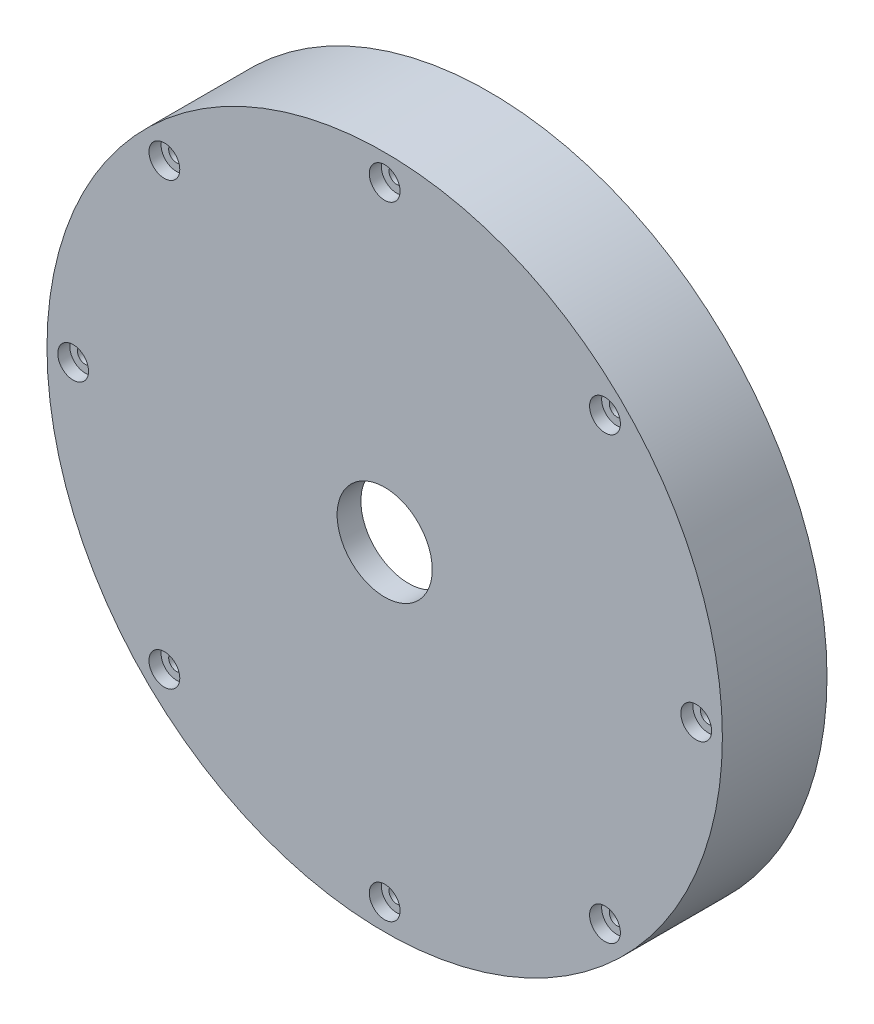
ISO-10303-21;
HEADER;
FILE_DESCRIPTION(('STEP AP214'),'2;1');
FILE_NAME('part.step','',(''),(''),'','','');
FILE_SCHEMA(('AUTOMOTIVE_DESIGN { 1 0 10303 214 1 1 1 1 }'));
ENDSEC;
DATA;
#1=APPLICATION_CONTEXT('core data for automotive mechanical design processes');
#2=APPLICATION_PROTOCOL_DEFINITION('international standard','automotive_design',2000,#1);
#3=PRODUCT_CONTEXT('',#1,'mechanical');
#4=PRODUCT('Part','Part','',(#3));
#5=PRODUCT_RELATED_PRODUCT_CATEGORY('part','',(#4));
#6=PRODUCT_DEFINITION_FORMATION('','',#4);
#7=PRODUCT_DEFINITION_CONTEXT('part definition',#1,'design');
#8=PRODUCT_DEFINITION('design','',#6,#7);
#9=PRODUCT_DEFINITION_SHAPE('','',#8);
#10=(LENGTH_UNIT() NAMED_UNIT(*) SI_UNIT(.MILLI.,.METRE.));
#11=(NAMED_UNIT(*) PLANE_ANGLE_UNIT() SI_UNIT($,.RADIAN.));
#12=(NAMED_UNIT(*) SI_UNIT($,.STERADIAN.) SOLID_ANGLE_UNIT());
#13=UNCERTAINTY_MEASURE_WITH_UNIT(LENGTH_MEASURE(1.E-05),#10,'distance_accuracy_value','');
#14=(GEOMETRIC_REPRESENTATION_CONTEXT(3) GLOBAL_UNCERTAINTY_ASSIGNED_CONTEXT((#13)) GLOBAL_UNIT_ASSIGNED_CONTEXT((#10,
#11,#12)) REPRESENTATION_CONTEXT('',''));
#15=CARTESIAN_POINT('',(0.,0.,0.));
#16=DIRECTION('',(0.,0.,1.));
#17=DIRECTION('',(1.,0.,0.));
#18=AXIS2_PLACEMENT_3D('',#15,#16,#17);
#19=CARTESIAN_POINT('',(46.3154941677197,46.3154941677208,0.));
#20=DIRECTION('',(0.,0.,1.));
#21=DIRECTION('',(1.,0.,0.));
#22=AXIS2_PLACEMENT_3D('',#19,#20,#21);
#23=CYLINDRICAL_SURFACE('',#22,1.63703000000032);
#24=CARTESIAN_POINT('',(46.3154941677197,46.3154941677208,0.));
#25=DIRECTION('',(0.,0.,1.));
#26=DIRECTION('',(1.,0.,0.));
#27=AXIS2_PLACEMENT_3D('',#24,#25,#26);
#28=CIRCLE('',#27,1.63703000000032);
#29=CARTESIAN_POINT('',(47.95252416772,46.3154941677208,0.));
#30=VERTEX_POINT('',#29);
#31=EDGE_CURVE('E87',#30,#30,#28,.T.);
#32=ORIENTED_EDGE('',*,*,#31,.F.);
#33=EDGE_LOOP('',(#32));
#34=FACE_BOUND('',#33,.T.);
#35=CARTESIAN_POINT('',(46.3154941677197,46.3154941677208,19.46));
#36=DIRECTION('',(0.,0.,1.));
#37=DIRECTION('',(1.,0.,0.));
#38=AXIS2_PLACEMENT_3D('',#35,#36,#37);
#39=CIRCLE('',#38,1.63703000000032);
#40=CARTESIAN_POINT('',(47.95252416772,46.3154941677208,19.46));
#41=VERTEX_POINT('',#40);
#42=EDGE_CURVE('E35',#41,#41,#39,.F.);
#43=ORIENTED_EDGE('',*,*,#42,.F.);
#44=EDGE_LOOP('',(#43));
#45=FACE_BOUND('',#44,.T.);
#46=ADVANCED_FACE('F31',(#34,#45),#23,.F.);
#47=CARTESIAN_POINT('',(0.,65.5,0.));
#48=DIRECTION('',(0.,0.,1.));
#49=DIRECTION('',(1.,0.,0.));
#50=AXIS2_PLACEMENT_3D('',#47,#48,#49);
#51=CYLINDRICAL_SURFACE('',#50,1.63703);
#52=CARTESIAN_POINT('',(0.,65.5,0.));
#53=DIRECTION('',(0.,0.,1.));
#54=DIRECTION('',(1.,0.,0.));
#55=AXIS2_PLACEMENT_3D('',#52,#53,#54);
#56=CIRCLE('',#55,1.63703);
#57=CARTESIAN_POINT('',(1.63703,65.5,0.));
#58=VERTEX_POINT('',#57);
#59=EDGE_CURVE('E71',#58,#58,#56,.T.);
#60=ORIENTED_EDGE('',*,*,#59,.F.);
#61=EDGE_LOOP('',(#60));
#62=FACE_BOUND('',#61,.T.);
#63=CARTESIAN_POINT('',(0.,65.5,19.46));
#64=DIRECTION('',(0.,0.,1.));
#65=DIRECTION('',(1.,0.,0.));
#66=AXIS2_PLACEMENT_3D('',#63,#64,#65);
#67=CIRCLE('',#66,1.63703);
#68=CARTESIAN_POINT('',(1.63703,65.5,19.46));
#69=VERTEX_POINT('',#68);
#70=EDGE_CURVE('E66',#69,#69,#67,.F.);
#71=ORIENTED_EDGE('',*,*,#70,.F.);
#72=EDGE_LOOP('',(#71));
#73=FACE_BOUND('',#72,.T.);
#74=ADVANCED_FACE('F127',(#62,#73),#51,.F.);
#75=CARTESIAN_POINT('',(-46.3154941677181,46.3154941677169,0.));
#76=DIRECTION('',(0.,0.,1.));
#77=DIRECTION('',(1.,0.,0.));
#78=AXIS2_PLACEMENT_3D('',#75,#76,#77);
#79=CYLINDRICAL_SURFACE('',#78,1.63703000000213);
#80=CARTESIAN_POINT('',(-46.3154941677181,46.3154941677169,0.));
#81=DIRECTION('',(0.,0.,1.));
#82=DIRECTION('',(1.,0.,0.));
#83=AXIS2_PLACEMENT_3D('',#80,#81,#82);
#84=CIRCLE('',#83,1.63703000000213);
#85=CARTESIAN_POINT('',(-44.6784641677159,46.3154941677169,0.));
#86=VERTEX_POINT('',#85);
#87=EDGE_CURVE('E75',#86,#86,#84,.T.);
#88=ORIENTED_EDGE('',*,*,#87,.F.);
#89=EDGE_LOOP('',(#88));
#90=FACE_BOUND('',#89,.T.);
#91=CARTESIAN_POINT('',(-46.3154941677181,46.3154941677169,19.46));
#92=DIRECTION('',(0.,0.,1.));
#93=DIRECTION('',(1.,0.,0.));
#94=AXIS2_PLACEMENT_3D('',#91,#92,#93);
#95=CIRCLE('',#94,1.63703000000213);
#96=CARTESIAN_POINT('',(-44.6784641677159,46.3154941677169,19.46));
#97=VERTEX_POINT('',#96);
#98=EDGE_CURVE('E64',#97,#97,#95,.F.);
#99=ORIENTED_EDGE('',*,*,#98,.F.);
#100=EDGE_LOOP('',(#99));
#101=FACE_BOUND('',#100,.T.);
#102=ADVANCED_FACE('F133',(#90,#101),#79,.F.);
#103=CARTESIAN_POINT('',(-65.4999999999972,-2.78842223326999E-12,0.));
#104=DIRECTION('',(0.,0.,1.));
#105=DIRECTION('',(1.,0.,0.));
#106=AXIS2_PLACEMENT_3D('',#103,#104,#105);
#107=CYLINDRICAL_SURFACE('',#106,1.63703000000413);
#108=CARTESIAN_POINT('',(-65.4999999999972,-2.78842223326999E-12,0.));
#109=DIRECTION('',(0.,0.,1.));
#110=DIRECTION('',(1.,0.,0.));
#111=AXIS2_PLACEMENT_3D('',#108,#109,#110);
#112=CIRCLE('',#111,1.63703000000413);
#113=CARTESIAN_POINT('',(-63.8629699999931,-2.78842223326999E-12,0.));
#114=VERTEX_POINT('',#113);
#115=EDGE_CURVE('E80',#114,#114,#112,.T.);
#116=ORIENTED_EDGE('',*,*,#115,.F.);
#117=EDGE_LOOP('',(#116));
#118=FACE_BOUND('',#117,.T.);
#119=CARTESIAN_POINT('',(-65.4999999999972,-2.78842223326999E-12,19.46));
#120=DIRECTION('',(0.,0.,1.));
#121=DIRECTION('',(1.,0.,0.));
#122=AXIS2_PLACEMENT_3D('',#119,#120,#121);
#123=CIRCLE('',#122,1.63703000000413);
#124=CARTESIAN_POINT('',(-63.8629699999931,-2.78842223326999E-12,19.46));
#125=VERTEX_POINT('',#124);
#126=EDGE_CURVE('E61',#125,#125,#123,.F.);
#127=ORIENTED_EDGE('',*,*,#126,.F.);
#128=EDGE_LOOP('',(#127));
#129=FACE_BOUND('',#128,.T.);
#130=ADVANCED_FACE('F207',(#118,#129),#107,.F.);
#131=CARTESIAN_POINT('',(-46.3154941677141,-46.3154941677208,0.));
#132=DIRECTION('',(0.,0.,1.));
#133=DIRECTION('',(1.,0.,0.));
#134=AXIS2_PLACEMENT_3D('',#131,#132,#133);
#135=CYLINDRICAL_SURFACE('',#134,1.63703000000566);
#136=CARTESIAN_POINT('',(-46.3154941677141,-46.3154941677208,0.));
#137=DIRECTION('',(0.,0.,1.));
#138=DIRECTION('',(1.,0.,0.));
#139=AXIS2_PLACEMENT_3D('',#136,#137,#138);
#140=CIRCLE('',#139,1.63703000000566);
#141=CARTESIAN_POINT('',(-44.6784641677085,-46.3154941677208,0.));
#142=VERTEX_POINT('',#141);
#143=EDGE_CURVE('E94',#142,#142,#140,.T.);
#144=ORIENTED_EDGE('',*,*,#143,.F.);
#145=EDGE_LOOP('',(#144));
#146=FACE_BOUND('',#145,.T.);
#147=CARTESIAN_POINT('',(-46.3154941677141,-46.3154941677208,19.46));
#148=DIRECTION('',(0.,0.,1.));
#149=DIRECTION('',(1.,0.,0.));
#150=AXIS2_PLACEMENT_3D('',#147,#148,#149);
#151=CIRCLE('',#150,1.63703000000566);
#152=CARTESIAN_POINT('',(-44.6784641677085,-46.3154941677208,19.46));
#153=VERTEX_POINT('',#152);
#154=EDGE_CURVE('E58',#153,#153,#151,.F.);
#155=ORIENTED_EDGE('',*,*,#154,.F.);
#156=EDGE_LOOP('',(#155));
#157=FACE_BOUND('',#156,.T.);
#158=ADVANCED_FACE('F140',(#146,#157),#135,.F.);
#159=CARTESIAN_POINT('',(5.56080159347114E-12,-65.5,0.));
#160=DIRECTION('',(0.,0.,1.));
#161=DIRECTION('',(1.,0.,0.));
#162=AXIS2_PLACEMENT_3D('',#159,#160,#161);
#163=CYLINDRICAL_SURFACE('',#162,1.63703000000575);
#164=CARTESIAN_POINT('',(5.56080159347114E-12,-65.5,0.));
#165=DIRECTION('',(0.,0.,1.));
#166=DIRECTION('',(1.,0.,0.));
#167=AXIS2_PLACEMENT_3D('',#164,#165,#166);
#168=CIRCLE('',#167,1.63703000000575);
#169=CARTESIAN_POINT('',(1.63703000001131,-65.5,0.));
#170=VERTEX_POINT('',#169);
#171=EDGE_CURVE('E91',#170,#170,#168,.T.);
#172=ORIENTED_EDGE('',*,*,#171,.F.);
#173=EDGE_LOOP('',(#172));
#174=FACE_BOUND('',#173,.T.);
#175=CARTESIAN_POINT('',(5.56080159347114E-12,-65.5,19.46));
#176=DIRECTION('',(0.,0.,1.));
#177=DIRECTION('',(1.,0.,0.));
#178=AXIS2_PLACEMENT_3D('',#175,#176,#177);
#179=CIRCLE('',#178,1.63703000000575);
#180=CARTESIAN_POINT('',(1.63703000001131,-65.5,19.46));
#181=VERTEX_POINT('',#180);
#182=EDGE_CURVE('E55',#181,#181,#179,.F.);
#183=ORIENTED_EDGE('',*,*,#182,.F.);
#184=EDGE_LOOP('',(#183));
#185=FACE_BOUND('',#184,.T.);
#186=ADVANCED_FACE('F221',(#174,#185),#163,.F.);
#187=CARTESIAN_POINT('',(46.3154941677236,-46.3154941677169,0.));
#188=DIRECTION('',(0.,0.,1.));
#189=DIRECTION('',(1.,0.,0.));
#190=AXIS2_PLACEMENT_3D('',#187,#188,#189);
#191=CYLINDRICAL_SURFACE('',#190,1.63703000000429);
#192=CARTESIAN_POINT('',(46.3154941677236,-46.3154941677169,0.));
#193=DIRECTION('',(0.,0.,1.));
#194=DIRECTION('',(1.,0.,0.));
#195=AXIS2_PLACEMENT_3D('',#192,#193,#194);
#196=CIRCLE('',#195,1.63703000000429);
#197=CARTESIAN_POINT('',(47.9525241677279,-46.3154941677169,0.));
#198=VERTEX_POINT('',#197);
#199=EDGE_CURVE('E88',#198,#198,#196,.T.);
#200=ORIENTED_EDGE('',*,*,#199,.F.);
#201=EDGE_LOOP('',(#200));
#202=FACE_BOUND('',#201,.T.);
#203=CARTESIAN_POINT('',(46.3154941677236,-46.3154941677169,19.46));
#204=DIRECTION('',(0.,0.,1.));
#205=DIRECTION('',(1.,0.,0.));
#206=AXIS2_PLACEMENT_3D('',#203,#204,#205);
#207=CIRCLE('',#206,1.63703000000429);
#208=CARTESIAN_POINT('',(47.9525241677279,-46.3154941677169,19.46));
#209=VERTEX_POINT('',#208);
#210=EDGE_CURVE('E51',#209,#209,#207,.F.);
#211=ORIENTED_EDGE('',*,*,#210,.F.);
#212=EDGE_LOOP('',(#211));
#213=FACE_BOUND('',#212,.T.);
#214=ADVANCED_FACE('F218',(#202,#213),#191,.F.);
#215=CARTESIAN_POINT('',(65.5000000000028,2.78040079673557E-12,0.));
#216=DIRECTION('',(0.,0.,1.));
#217=DIRECTION('',(1.,0.,0.));
#218=AXIS2_PLACEMENT_3D('',#215,#216,#217);
#219=CYLINDRICAL_SURFACE('',#218,1.63703000000207);
#220=CARTESIAN_POINT('',(65.5000000000028,2.78040079673557E-12,0.));
#221=DIRECTION('',(0.,0.,1.));
#222=DIRECTION('',(1.,0.,0.));
#223=AXIS2_PLACEMENT_3D('',#220,#221,#222);
#224=CIRCLE('',#223,1.63703000000207);
#225=CARTESIAN_POINT('',(67.1370300000048,2.78040079673557E-12,0.));
#226=VERTEX_POINT('',#225);
#227=EDGE_CURVE('E84',#226,#226,#224,.T.);
#228=ORIENTED_EDGE('',*,*,#227,.F.);
#229=EDGE_LOOP('',(#228));
#230=FACE_BOUND('',#229,.T.);
#231=CARTESIAN_POINT('',(65.5000000000028,2.78040079673557E-12,19.46));
#232=DIRECTION('',(0.,0.,1.));
#233=DIRECTION('',(1.,0.,0.));
#234=AXIS2_PLACEMENT_3D('',#231,#232,#233);
#235=CIRCLE('',#234,1.63703000000207);
#236=CARTESIAN_POINT('',(67.1370300000048,2.78040079673557E-12,19.46));
#237=VERTEX_POINT('',#236);
#238=EDGE_CURVE('E48',#237,#237,#235,.F.);
#239=ORIENTED_EDGE('',*,*,#238,.F.);
#240=EDGE_LOOP('',(#239));
#241=FACE_BOUND('',#240,.T.);
#242=ADVANCED_FACE('F214',(#230,#241),#219,.F.);
#243=CARTESIAN_POINT('',(0.,0.,0.));
#244=DIRECTION('',(0.,0.,1.));
#245=DIRECTION('',(1.,0.,0.));
#246=AXIS2_PLACEMENT_3D('',#243,#244,#245);
#247=PLANE('',#246);
#248=ORIENTED_EDGE('',*,*,#227,.T.);
#249=EDGE_LOOP('',(#248));
#250=FACE_BOUND('',#249,.T.);
#251=ORIENTED_EDGE('',*,*,#199,.T.);
#252=EDGE_LOOP('',(#251));
#253=FACE_BOUND('',#252,.T.);
#254=ORIENTED_EDGE('',*,*,#171,.T.);
#255=EDGE_LOOP('',(#254));
#256=FACE_BOUND('',#255,.T.);
#257=ORIENTED_EDGE('',*,*,#143,.T.);
#258=EDGE_LOOP('',(#257));
#259=FACE_BOUND('',#258,.T.);
#260=ORIENTED_EDGE('',*,*,#115,.T.);
#261=EDGE_LOOP('',(#260));
#262=FACE_BOUND('',#261,.T.);
#263=ORIENTED_EDGE('',*,*,#87,.T.);
#264=EDGE_LOOP('',(#263));
#265=FACE_BOUND('',#264,.T.);
#266=ORIENTED_EDGE('',*,*,#59,.T.);
#267=EDGE_LOOP('',(#266));
#268=FACE_BOUND('',#267,.T.);
#269=ORIENTED_EDGE('',*,*,#31,.T.);
#270=EDGE_LOOP('',(#269));
#271=FACE_BOUND('',#270,.T.);
#272=CARTESIAN_POINT('',(0.,0.,0.));
#273=DIRECTION('',(0.,0.,1.));
#274=DIRECTION('',(1.,0.,0.));
#275=AXIS2_PLACEMENT_3D('',#272,#273,#274);
#276=CIRCLE('',#275,71.);
#277=CARTESIAN_POINT('',(71.,0.,0.));
#278=VERTEX_POINT('',#277);
#279=EDGE_CURVE('E10',#278,#278,#276,.T.);
#280=ORIENTED_EDGE('',*,*,#279,.F.);
#281=EDGE_LOOP('',(#280));
#282=FACE_BOUND('',#281,.T.);
#283=CARTESIAN_POINT('',(0.,0.,0.));
#284=DIRECTION('',(0.,0.,1.));
#285=DIRECTION('',(1.,0.,0.));
#286=AXIS2_PLACEMENT_3D('',#283,#284,#285);
#287=CIRCLE('',#286,60.);
#288=CARTESIAN_POINT('',(60.,0.,0.));
#289=VERTEX_POINT('',#288);
#290=EDGE_CURVE('E39',#289,#289,#287,.T.);
#291=ORIENTED_EDGE('',*,*,#290,.T.);
#292=EDGE_LOOP('',(#291));
#293=FACE_BOUND('',#292,.T.);
#294=ADVANCED_FACE('F217',(#250,#253,#256,#259,#262,#265,#268,#271,#282,#293),#247,.F.);
#295=CARTESIAN_POINT('',(0.,0.,17.));
#296=DIRECTION('',(0.,0.,-1.));
#297=DIRECTION('',(-1.,0.,0.));
#298=AXIS2_PLACEMENT_3D('',#295,#296,#297);
#299=CYLINDRICAL_SURFACE('',#298,71.);
#300=ORIENTED_EDGE('',*,*,#279,.T.);
#301=EDGE_LOOP('',(#300));
#302=FACE_BOUND('',#301,.T.);
#303=CARTESIAN_POINT('',(0.,0.,22.));
#304=DIRECTION('',(0.,0.,1.));
#305=DIRECTION('',(1.,0.,0.));
#306=AXIS2_PLACEMENT_3D('',#303,#304,#305);
#307=CIRCLE('',#306,71.);
#308=CARTESIAN_POINT('',(71.,0.,22.));
#309=VERTEX_POINT('',#308);
#310=EDGE_CURVE('E103',#309,#309,#307,.T.);
#311=ORIENTED_EDGE('',*,*,#310,.F.);
#312=EDGE_LOOP('',(#311));
#313=FACE_BOUND('',#312,.T.);
#314=ADVANCED_FACE('F33',(#302,#313),#299,.T.);
#315=CARTESIAN_POINT('',(0.,0.,17.));
#316=DIRECTION('',(0.,0.,-1.));
#317=DIRECTION('',(-1.,0.,0.));
#318=AXIS2_PLACEMENT_3D('',#315,#316,#317);
#319=CYLINDRICAL_SURFACE('',#318,60.);
#320=CARTESIAN_POINT('',(0.,0.,17.));
#321=DIRECTION('',(0.,0.,1.));
#322=DIRECTION('',(1.,0.,0.));
#323=AXIS2_PLACEMENT_3D('',#320,#321,#322);
#324=CIRCLE('',#323,60.);
#325=CARTESIAN_POINT('',(60.,0.,17.));
#326=VERTEX_POINT('',#325);
#327=EDGE_CURVE('E44',#326,#326,#324,.T.);
#328=ORIENTED_EDGE('',*,*,#327,.T.);
#329=EDGE_LOOP('',(#328));
#330=FACE_BOUND('',#329,.T.);
#331=ORIENTED_EDGE('',*,*,#290,.F.);
#332=EDGE_LOOP('',(#331));
#333=FACE_BOUND('',#332,.T.);
#334=ADVANCED_FACE('F110',(#330,#333),#319,.F.);
#335=CARTESIAN_POINT('',(0.,0.,17.));
#336=DIRECTION('',(0.,0.,1.));
#337=DIRECTION('',(1.,0.,0.));
#338=AXIS2_PLACEMENT_3D('',#335,#336,#337);
#339=PLANE('',#338);
#340=CARTESIAN_POINT('',(0.,0.,17.));
#341=DIRECTION('',(0.,0.,1.));
#342=DIRECTION('',(1.,0.,0.));
#343=AXIS2_PLACEMENT_3D('',#340,#341,#342);
#344=CIRCLE('',#343,10.);
#345=CARTESIAN_POINT('',(10.,0.,17.));
#346=VERTEX_POINT('',#345);
#347=EDGE_CURVE('E99',#346,#346,#344,.T.);
#348=ORIENTED_EDGE('',*,*,#347,.T.);
#349=EDGE_LOOP('',(#348));
#350=FACE_BOUND('',#349,.T.);
#351=ORIENTED_EDGE('',*,*,#327,.F.);
#352=EDGE_LOOP('',(#351));
#353=FACE_BOUND('',#352,.T.);
#354=ADVANCED_FACE('F113',(#350,#353),#339,.F.);
#355=CARTESIAN_POINT('',(0.,0.,22.));
#356=DIRECTION('',(0.,0.,1.));
#357=DIRECTION('',(1.,0.,0.));
#358=AXIS2_PLACEMENT_3D('',#355,#356,#357);
#359=PLANE('',#358);
#360=CARTESIAN_POINT('',(0.,65.5,22.));
#361=DIRECTION('',(0.,0.,1.));
#362=DIRECTION('',(1.,0.,0.));
#363=AXIS2_PLACEMENT_3D('',#360,#361,#362);
#364=CIRCLE('',#363,3.2385);
#365=CARTESIAN_POINT('',(3.2385,65.5,22.));
#366=VERTEX_POINT('',#365);
#367=EDGE_CURVE('E292',#366,#366,#364,.T.);
#368=ORIENTED_EDGE('',*,*,#367,.F.);
#369=EDGE_LOOP('',(#368));
#370=FACE_BOUND('',#369,.T.);
#371=CARTESIAN_POINT('',(46.3154941677197,46.3154941677208,22.));
#372=DIRECTION('',(0.,0.,1.));
#373=DIRECTION('',(1.,0.,0.));
#374=AXIS2_PLACEMENT_3D('',#371,#372,#373);
#375=CIRCLE('',#374,3.23850000000032);
#376=CARTESIAN_POINT('',(49.55399416772,46.3154941677208,22.));
#377=VERTEX_POINT('',#376);
#378=EDGE_CURVE('E286',#377,#377,#375,.T.);
#379=ORIENTED_EDGE('',*,*,#378,.F.);
#380=EDGE_LOOP('',(#379));
#381=FACE_BOUND('',#380,.T.);
#382=CARTESIAN_POINT('',(65.5000000000028,2.78040079673557E-12,22.));
#383=DIRECTION('',(0.,0.,1.));
#384=DIRECTION('',(1.,0.,0.));
#385=AXIS2_PLACEMENT_3D('',#382,#383,#384);
#386=CIRCLE('',#385,3.23850000000207);
#387=CARTESIAN_POINT('',(68.7385000000048,2.78040079673557E-12,22.));
#388=VERTEX_POINT('',#387);
#389=EDGE_CURVE('E281',#388,#388,#386,.T.);
#390=ORIENTED_EDGE('',*,*,#389,.F.);
#391=EDGE_LOOP('',(#390));
#392=FACE_BOUND('',#391,.T.);
#393=CARTESIAN_POINT('',(46.3154941677236,-46.3154941677169,22.));
#394=DIRECTION('',(0.,0.,1.));
#395=DIRECTION('',(1.,0.,0.));
#396=AXIS2_PLACEMENT_3D('',#393,#394,#395);
#397=CIRCLE('',#396,3.23850000000429);
#398=CARTESIAN_POINT('',(49.5539941677279,-46.3154941677169,22.));
#399=VERTEX_POINT('',#398);
#400=EDGE_CURVE('E275',#399,#399,#397,.T.);
#401=ORIENTED_EDGE('',*,*,#400,.F.);
#402=EDGE_LOOP('',(#401));
#403=FACE_BOUND('',#402,.T.);
#404=CARTESIAN_POINT('',(5.56080159347114E-12,-65.5,22.));
#405=DIRECTION('',(0.,0.,1.));
#406=DIRECTION('',(1.,0.,0.));
#407=AXIS2_PLACEMENT_3D('',#404,#405,#406);
#408=CIRCLE('',#407,3.23850000000575);
#409=CARTESIAN_POINT('',(3.23850000001131,-65.5,22.));
#410=VERTEX_POINT('',#409);
#411=EDGE_CURVE('E269',#410,#410,#408,.T.);
#412=ORIENTED_EDGE('',*,*,#411,.F.);
#413=EDGE_LOOP('',(#412));
#414=FACE_BOUND('',#413,.T.);
#415=CARTESIAN_POINT('',(-46.3154941677141,-46.3154941677208,22.));
#416=DIRECTION('',(0.,0.,1.));
#417=DIRECTION('',(1.,0.,0.));
#418=AXIS2_PLACEMENT_3D('',#415,#416,#417);
#419=CIRCLE('',#418,3.23850000000566);
#420=CARTESIAN_POINT('',(-43.0769941677085,-46.3154941677208,22.));
#421=VERTEX_POINT('',#420);
#422=EDGE_CURVE('E263',#421,#421,#419,.T.);
#423=ORIENTED_EDGE('',*,*,#422,.F.);
#424=EDGE_LOOP('',(#423));
#425=FACE_BOUND('',#424,.T.);
#426=CARTESIAN_POINT('',(-65.4999999999972,-2.78842223326999E-12,22.));
#427=DIRECTION('',(0.,0.,1.));
#428=DIRECTION('',(1.,0.,0.));
#429=AXIS2_PLACEMENT_3D('',#426,#427,#428);
#430=CIRCLE('',#429,3.23850000000413);
#431=CARTESIAN_POINT('',(-62.2614999999931,-2.78842223326999E-12,22.));
#432=VERTEX_POINT('',#431);
#433=EDGE_CURVE('E257',#432,#432,#430,.T.);
#434=ORIENTED_EDGE('',*,*,#433,.F.);
#435=EDGE_LOOP('',(#434));
#436=FACE_BOUND('',#435,.T.);
#437=CARTESIAN_POINT('',(-46.3154941677181,46.3154941677169,22.));
#438=DIRECTION('',(0.,0.,1.));
#439=DIRECTION('',(1.,0.,0.));
#440=AXIS2_PLACEMENT_3D('',#437,#438,#439);
#441=CIRCLE('',#440,3.23850000000213);
#442=CARTESIAN_POINT('',(-43.0769941677159,46.3154941677169,22.));
#443=VERTEX_POINT('',#442);
#444=EDGE_CURVE('E251',#443,#443,#441,.T.);
#445=ORIENTED_EDGE('',*,*,#444,.F.);
#446=EDGE_LOOP('',(#445));
#447=FACE_BOUND('',#446,.T.);
#448=ORIENTED_EDGE('',*,*,#310,.T.);
#449=EDGE_LOOP('',(#448));
#450=FACE_BOUND('',#449,.T.);
#451=CARTESIAN_POINT('',(0.,0.,22.));
#452=DIRECTION('',(0.,0.,1.));
#453=DIRECTION('',(1.,0.,0.));
#454=AXIS2_PLACEMENT_3D('',#451,#452,#453);
#455=CIRCLE('',#454,10.);
#456=CARTESIAN_POINT('',(10.,0.,22.));
#457=VERTEX_POINT('',#456);
#458=EDGE_CURVE('E100',#457,#457,#455,.T.);
#459=ORIENTED_EDGE('',*,*,#458,.F.);
#460=EDGE_LOOP('',(#459));
#461=FACE_BOUND('',#460,.T.);
#462=ADVANCED_FACE('F115',(#370,#381,#392,#403,#414,#425,#436,#447,#450,#461),#359,.T.);
#463=CARTESIAN_POINT('',(0.,0.,22.));
#464=DIRECTION('',(0.,0.,-1.));
#465=DIRECTION('',(-1.,0.,0.));
#466=AXIS2_PLACEMENT_3D('',#463,#464,#465);
#467=CYLINDRICAL_SURFACE('',#466,10.);
#468=ORIENTED_EDGE('',*,*,#458,.T.);
#469=EDGE_LOOP('',(#468));
#470=FACE_BOUND('',#469,.T.);
#471=ORIENTED_EDGE('',*,*,#347,.F.);
#472=EDGE_LOOP('',(#471));
#473=FACE_BOUND('',#472,.T.);
#474=ADVANCED_FACE('F122',(#470,#473),#467,.F.);
#475=CARTESIAN_POINT('',(65.5000000000028,2.78040079673557E-12,19.46));
#476=DIRECTION('',(0.,0.,1.));
#477=DIRECTION('',(1.,0.,0.));
#478=AXIS2_PLACEMENT_3D('',#475,#476,#477);
#479=PLANE('',#478);
#480=CARTESIAN_POINT('',(65.5000000000028,2.78040079673557E-12,19.46));
#481=DIRECTION('',(0.,0.,1.));
#482=DIRECTION('',(1.,0.,0.));
#483=AXIS2_PLACEMENT_3D('',#480,#481,#482);
#484=CIRCLE('',#483,3.23850000000207);
#485=CARTESIAN_POINT('',(68.7385000000048,2.78040079673557E-12,19.46));
#486=VERTEX_POINT('',#485);
#487=EDGE_CURVE('E284',#486,#486,#484,.T.);
#488=ORIENTED_EDGE('',*,*,#487,.T.);
#489=EDGE_LOOP('',(#488));
#490=FACE_BOUND('',#489,.T.);
#491=ORIENTED_EDGE('',*,*,#238,.T.);
#492=EDGE_LOOP('',(#491));
#493=FACE_BOUND('',#492,.T.);
#494=ADVANCED_FACE('F143',(#490,#493),#479,.T.);
#495=CARTESIAN_POINT('',(65.5000000000028,2.78040079673557E-12,19.46));
#496=DIRECTION('',(0.,0.,1.));
#497=DIRECTION('',(1.,0.,0.));
#498=AXIS2_PLACEMENT_3D('',#495,#496,#497);
#499=CYLINDRICAL_SURFACE('',#498,3.23850000000207);
#500=ORIENTED_EDGE('',*,*,#487,.F.);
#501=EDGE_LOOP('',(#500));
#502=FACE_BOUND('',#501,.T.);
#503=ORIENTED_EDGE('',*,*,#389,.T.);
#504=EDGE_LOOP('',(#503));
#505=FACE_BOUND('',#504,.T.);
#506=ADVANCED_FACE('F148',(#502,#505),#499,.F.);
#507=CARTESIAN_POINT('',(46.3154941677236,-46.3154941677169,19.46));
#508=DIRECTION('',(0.,0.,1.));
#509=DIRECTION('',(1.,0.,0.));
#510=AXIS2_PLACEMENT_3D('',#507,#508,#509);
#511=PLANE('',#510);
#512=CARTESIAN_POINT('',(46.3154941677236,-46.3154941677169,19.46));
#513=DIRECTION('',(0.,0.,1.));
#514=DIRECTION('',(1.,0.,0.));
#515=AXIS2_PLACEMENT_3D('',#512,#513,#514);
#516=CIRCLE('',#515,3.23850000000429);
#517=CARTESIAN_POINT('',(49.5539941677279,-46.3154941677169,19.46));
#518=VERTEX_POINT('',#517);
#519=EDGE_CURVE('E278',#518,#518,#516,.T.);
#520=ORIENTED_EDGE('',*,*,#519,.T.);
#521=EDGE_LOOP('',(#520));
#522=FACE_BOUND('',#521,.T.);
#523=ORIENTED_EDGE('',*,*,#210,.T.);
#524=EDGE_LOOP('',(#523));
#525=FACE_BOUND('',#524,.T.);
#526=ADVANCED_FACE('F158',(#522,#525),#511,.T.);
#527=CARTESIAN_POINT('',(46.3154941677236,-46.3154941677169,19.46));
#528=DIRECTION('',(0.,0.,1.));
#529=DIRECTION('',(1.,0.,0.));
#530=AXIS2_PLACEMENT_3D('',#527,#528,#529);
#531=CYLINDRICAL_SURFACE('',#530,3.23850000000429);
#532=ORIENTED_EDGE('',*,*,#519,.F.);
#533=EDGE_LOOP('',(#532));
#534=FACE_BOUND('',#533,.T.);
#535=ORIENTED_EDGE('',*,*,#400,.T.);
#536=EDGE_LOOP('',(#535));
#537=FACE_BOUND('',#536,.T.);
#538=ADVANCED_FACE('F169',(#534,#537),#531,.F.);
#539=CARTESIAN_POINT('',(5.56080159347114E-12,-65.5,19.46));
#540=DIRECTION('',(0.,0.,1.));
#541=DIRECTION('',(1.,0.,0.));
#542=AXIS2_PLACEMENT_3D('',#539,#540,#541);
#543=PLANE('',#542);
#544=CARTESIAN_POINT('',(5.56080159347114E-12,-65.5,19.46));
#545=DIRECTION('',(0.,0.,1.));
#546=DIRECTION('',(1.,0.,0.));
#547=AXIS2_PLACEMENT_3D('',#544,#545,#546);
#548=CIRCLE('',#547,3.23850000000575);
#549=CARTESIAN_POINT('',(3.23850000001131,-65.5,19.46));
#550=VERTEX_POINT('',#549);
#551=EDGE_CURVE('E272',#550,#550,#548,.T.);
#552=ORIENTED_EDGE('',*,*,#551,.T.);
#553=EDGE_LOOP('',(#552));
#554=FACE_BOUND('',#553,.T.);
#555=ORIENTED_EDGE('',*,*,#182,.T.);
#556=EDGE_LOOP('',(#555));
#557=FACE_BOUND('',#556,.T.);
#558=ADVANCED_FACE('F173',(#554,#557),#543,.T.);
#559=CARTESIAN_POINT('',(5.56080159347114E-12,-65.5,19.46));
#560=DIRECTION('',(0.,0.,1.));
#561=DIRECTION('',(1.,0.,0.));
#562=AXIS2_PLACEMENT_3D('',#559,#560,#561);
#563=CYLINDRICAL_SURFACE('',#562,3.23850000000575);
#564=ORIENTED_EDGE('',*,*,#551,.F.);
#565=EDGE_LOOP('',(#564));
#566=FACE_BOUND('',#565,.T.);
#567=ORIENTED_EDGE('',*,*,#411,.T.);
#568=EDGE_LOOP('',(#567));
#569=FACE_BOUND('',#568,.T.);
#570=ADVANCED_FACE('F177',(#566,#569),#563,.F.);
#571=CARTESIAN_POINT('',(-46.3154941677141,-46.3154941677208,19.46));
#572=DIRECTION('',(0.,0.,1.));
#573=DIRECTION('',(1.,0.,0.));
#574=AXIS2_PLACEMENT_3D('',#571,#572,#573);
#575=PLANE('',#574);
#576=CARTESIAN_POINT('',(-46.3154941677141,-46.3154941677208,19.46));
#577=DIRECTION('',(0.,0.,1.));
#578=DIRECTION('',(1.,0.,0.));
#579=AXIS2_PLACEMENT_3D('',#576,#577,#578);
#580=CIRCLE('',#579,3.23850000000566);
#581=CARTESIAN_POINT('',(-43.0769941677085,-46.3154941677208,19.46));
#582=VERTEX_POINT('',#581);
#583=EDGE_CURVE('E266',#582,#582,#580,.T.);
#584=ORIENTED_EDGE('',*,*,#583,.T.);
#585=EDGE_LOOP('',(#584));
#586=FACE_BOUND('',#585,.T.);
#587=ORIENTED_EDGE('',*,*,#154,.T.);
#588=EDGE_LOOP('',(#587));
#589=FACE_BOUND('',#588,.T.);
#590=ADVANCED_FACE('F181',(#586,#589),#575,.T.);
#591=CARTESIAN_POINT('',(-46.3154941677141,-46.3154941677208,19.46));
#592=DIRECTION('',(0.,0.,1.));
#593=DIRECTION('',(1.,0.,0.));
#594=AXIS2_PLACEMENT_3D('',#591,#592,#593);
#595=CYLINDRICAL_SURFACE('',#594,3.23850000000566);
#596=ORIENTED_EDGE('',*,*,#583,.F.);
#597=EDGE_LOOP('',(#596));
#598=FACE_BOUND('',#597,.T.);
#599=ORIENTED_EDGE('',*,*,#422,.T.);
#600=EDGE_LOOP('',(#599));
#601=FACE_BOUND('',#600,.T.);
#602=ADVANCED_FACE('F185',(#598,#601),#595,.F.);
#603=CARTESIAN_POINT('',(-65.4999999999972,-2.78842223326999E-12,19.46));
#604=DIRECTION('',(0.,0.,1.));
#605=DIRECTION('',(1.,0.,0.));
#606=AXIS2_PLACEMENT_3D('',#603,#604,#605);
#607=PLANE('',#606);
#608=CARTESIAN_POINT('',(-65.4999999999972,-2.78842223326999E-12,19.46));
#609=DIRECTION('',(0.,0.,1.));
#610=DIRECTION('',(1.,0.,0.));
#611=AXIS2_PLACEMENT_3D('',#608,#609,#610);
#612=CIRCLE('',#611,3.23850000000413);
#613=CARTESIAN_POINT('',(-62.2614999999931,-2.78842223326999E-12,19.46));
#614=VERTEX_POINT('',#613);
#615=EDGE_CURVE('E260',#614,#614,#612,.T.);
#616=ORIENTED_EDGE('',*,*,#615,.T.);
#617=EDGE_LOOP('',(#616));
#618=FACE_BOUND('',#617,.T.);
#619=ORIENTED_EDGE('',*,*,#126,.T.);
#620=EDGE_LOOP('',(#619));
#621=FACE_BOUND('',#620,.T.);
#622=ADVANCED_FACE('F189',(#618,#621),#607,.T.);
#623=CARTESIAN_POINT('',(-65.4999999999972,-2.78842223326999E-12,19.46));
#624=DIRECTION('',(0.,0.,1.));
#625=DIRECTION('',(1.,0.,0.));
#626=AXIS2_PLACEMENT_3D('',#623,#624,#625);
#627=CYLINDRICAL_SURFACE('',#626,3.23850000000413);
#628=ORIENTED_EDGE('',*,*,#615,.F.);
#629=EDGE_LOOP('',(#628));
#630=FACE_BOUND('',#629,.T.);
#631=ORIENTED_EDGE('',*,*,#433,.T.);
#632=EDGE_LOOP('',(#631));
#633=FACE_BOUND('',#632,.T.);
#634=ADVANCED_FACE('F193',(#630,#633),#627,.F.);
#635=CARTESIAN_POINT('',(-46.3154941677181,46.3154941677169,19.46));
#636=DIRECTION('',(0.,0.,1.));
#637=DIRECTION('',(1.,0.,0.));
#638=AXIS2_PLACEMENT_3D('',#635,#636,#637);
#639=PLANE('',#638);
#640=CARTESIAN_POINT('',(-46.3154941677181,46.3154941677169,19.46));
#641=DIRECTION('',(0.,0.,1.));
#642=DIRECTION('',(1.,0.,0.));
#643=AXIS2_PLACEMENT_3D('',#640,#641,#642);
#644=CIRCLE('',#643,3.23850000000213);
#645=CARTESIAN_POINT('',(-43.0769941677159,46.3154941677169,19.46));
#646=VERTEX_POINT('',#645);
#647=EDGE_CURVE('E254',#646,#646,#644,.T.);
#648=ORIENTED_EDGE('',*,*,#647,.T.);
#649=EDGE_LOOP('',(#648));
#650=FACE_BOUND('',#649,.T.);
#651=ORIENTED_EDGE('',*,*,#98,.T.);
#652=EDGE_LOOP('',(#651));
#653=FACE_BOUND('',#652,.T.);
#654=ADVANCED_FACE('F197',(#650,#653),#639,.T.);
#655=CARTESIAN_POINT('',(-46.3154941677181,46.3154941677169,19.46));
#656=DIRECTION('',(0.,0.,1.));
#657=DIRECTION('',(1.,0.,0.));
#658=AXIS2_PLACEMENT_3D('',#655,#656,#657);
#659=CYLINDRICAL_SURFACE('',#658,3.23850000000213);
#660=ORIENTED_EDGE('',*,*,#647,.F.);
#661=EDGE_LOOP('',(#660));
#662=FACE_BOUND('',#661,.T.);
#663=ORIENTED_EDGE('',*,*,#444,.T.);
#664=EDGE_LOOP('',(#663));
#665=FACE_BOUND('',#664,.T.);
#666=ADVANCED_FACE('F201',(#662,#665),#659,.F.);
#667=CARTESIAN_POINT('',(0.,65.5,19.46));
#668=DIRECTION('',(0.,0.,1.));
#669=DIRECTION('',(1.,0.,0.));
#670=AXIS2_PLACEMENT_3D('',#667,#668,#669);
#671=PLANE('',#670);
#672=CARTESIAN_POINT('',(0.,65.5,19.46));
#673=DIRECTION('',(0.,0.,1.));
#674=DIRECTION('',(1.,0.,0.));
#675=AXIS2_PLACEMENT_3D('',#672,#673,#674);
#676=CIRCLE('',#675,3.2385);
#677=CARTESIAN_POINT('',(3.2385,65.5,19.46));
#678=VERTEX_POINT('',#677);
#679=EDGE_CURVE('E52',#678,#678,#676,.T.);
#680=ORIENTED_EDGE('',*,*,#679,.T.);
#681=EDGE_LOOP('',(#680));
#682=FACE_BOUND('',#681,.T.);
#683=ORIENTED_EDGE('',*,*,#70,.T.);
#684=EDGE_LOOP('',(#683));
#685=FACE_BOUND('',#684,.T.);
#686=ADVANCED_FACE('F205',(#682,#685),#671,.T.);
#687=CARTESIAN_POINT('',(0.,65.5,19.46));
#688=DIRECTION('',(0.,0.,1.));
#689=DIRECTION('',(1.,0.,0.));
#690=AXIS2_PLACEMENT_3D('',#687,#688,#689);
#691=CYLINDRICAL_SURFACE('',#690,3.2385);
#692=ORIENTED_EDGE('',*,*,#679,.F.);
#693=EDGE_LOOP('',(#692));
#694=FACE_BOUND('',#693,.T.);
#695=ORIENTED_EDGE('',*,*,#367,.T.);
#696=EDGE_LOOP('',(#695));
#697=FACE_BOUND('',#696,.T.);
#698=ADVANCED_FACE('F299',(#694,#697),#691,.F.);
#699=CARTESIAN_POINT('',(46.3154941677197,46.3154941677208,19.46));
#700=DIRECTION('',(0.,0.,1.));
#701=DIRECTION('',(1.,0.,0.));
#702=AXIS2_PLACEMENT_3D('',#699,#700,#701);
#703=PLANE('',#702);
#704=CARTESIAN_POINT('',(46.3154941677197,46.3154941677208,19.46));
#705=DIRECTION('',(0.,0.,1.));
#706=DIRECTION('',(1.,0.,0.));
#707=AXIS2_PLACEMENT_3D('',#704,#705,#706);
#708=CIRCLE('',#707,3.23850000000032);
#709=CARTESIAN_POINT('',(49.55399416772,46.3154941677208,19.46));
#710=VERTEX_POINT('',#709);
#711=EDGE_CURVE('E289',#710,#710,#708,.T.);
#712=ORIENTED_EDGE('',*,*,#711,.T.);
#713=EDGE_LOOP('',(#712));
#714=FACE_BOUND('',#713,.T.);
#715=ORIENTED_EDGE('',*,*,#42,.T.);
#716=EDGE_LOOP('',(#715));
#717=FACE_BOUND('',#716,.T.);
#718=ADVANCED_FACE('F302',(#714,#717),#703,.T.);
#719=CARTESIAN_POINT('',(46.3154941677197,46.3154941677208,19.46));
#720=DIRECTION('',(0.,0.,1.));
#721=DIRECTION('',(1.,0.,0.));
#722=AXIS2_PLACEMENT_3D('',#719,#720,#721);
#723=CYLINDRICAL_SURFACE('',#722,3.23850000000032);
#724=ORIENTED_EDGE('',*,*,#711,.F.);
#725=EDGE_LOOP('',(#724));
#726=FACE_BOUND('',#725,.T.);
#727=ORIENTED_EDGE('',*,*,#378,.T.);
#728=EDGE_LOOP('',(#727));
#729=FACE_BOUND('',#728,.T.);
#730=ADVANCED_FACE('F164',(#726,#729),#723,.F.);
#731=CLOSED_SHELL('',(#46,#74,#102,#130,#158,#186,#214,#242,#294,#314,#334,#354,#462,#474,#494,
#506,#526,#538,#558,#570,#590,#602,#622,#634,#654,#666,#686,#698,#718,#730));
#732=MANIFOLD_SOLID_BREP('B2',#731);
#733=ADVANCED_BREP_SHAPE_REPRESENTATION('',(#18,#732),#14);
#734=SHAPE_DEFINITION_REPRESENTATION(#9,#733);
ENDSEC;
END-ISO-10303-21;
